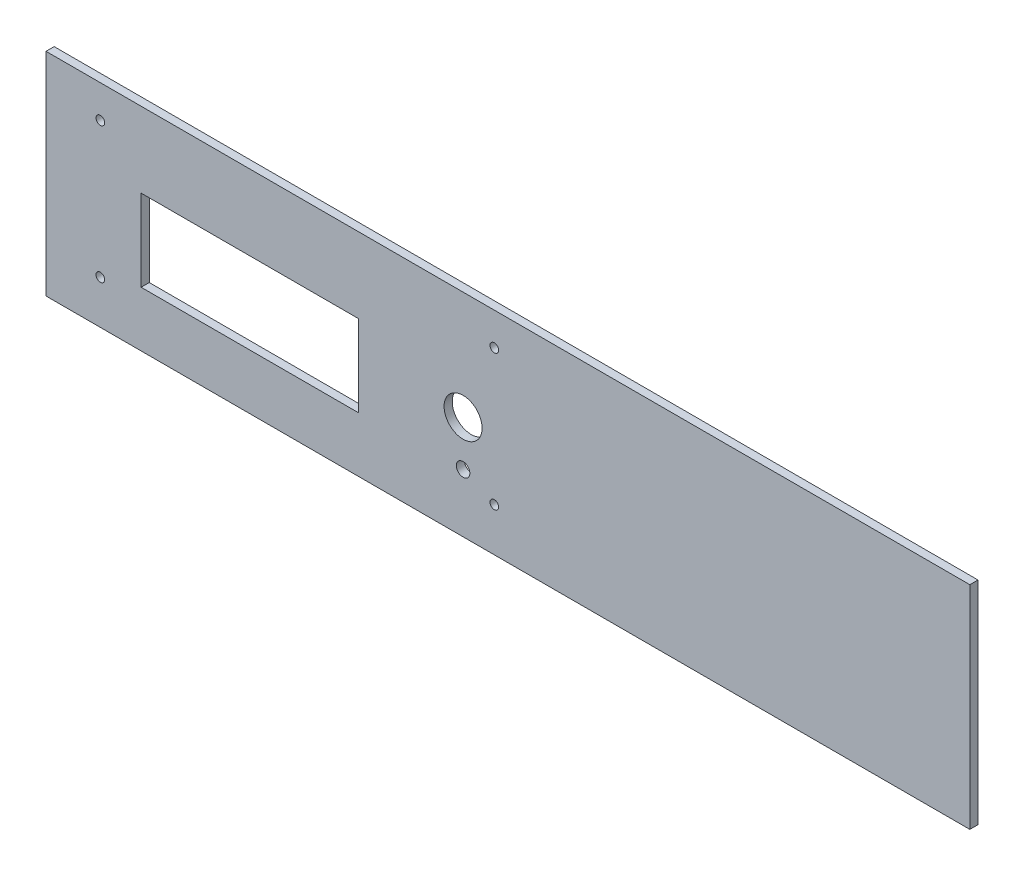
ISO-10303-21;
HEADER;
FILE_DESCRIPTION(('STEP AP214'),'2;1');
FILE_NAME('part.step','',(''),(''),'','','');
FILE_SCHEMA(('AUTOMOTIVE_DESIGN { 1 0 10303 214 1 1 1 1 }'));
ENDSEC;
DATA;
#1=APPLICATION_CONTEXT('core data for automotive mechanical design processes');
#2=APPLICATION_PROTOCOL_DEFINITION('international standard','automotive_design',2000,#1);
#3=PRODUCT_CONTEXT('',#1,'mechanical');
#4=PRODUCT('Part','Part','',(#3));
#5=PRODUCT_RELATED_PRODUCT_CATEGORY('part','',(#4));
#6=PRODUCT_DEFINITION_FORMATION('','',#4);
#7=PRODUCT_DEFINITION_CONTEXT('part definition',#1,'design');
#8=PRODUCT_DEFINITION('design','',#6,#7);
#9=PRODUCT_DEFINITION_SHAPE('','',#8);
#10=(LENGTH_UNIT() NAMED_UNIT(*) SI_UNIT(.MILLI.,.METRE.));
#11=(NAMED_UNIT(*) PLANE_ANGLE_UNIT() SI_UNIT($,.RADIAN.));
#12=(NAMED_UNIT(*) SI_UNIT($,.STERADIAN.) SOLID_ANGLE_UNIT());
#13=UNCERTAINTY_MEASURE_WITH_UNIT(LENGTH_MEASURE(1.E-05),#10,'distance_accuracy_value','');
#14=(GEOMETRIC_REPRESENTATION_CONTEXT(3) GLOBAL_UNCERTAINTY_ASSIGNED_CONTEXT((#13)) GLOBAL_UNIT_ASSIGNED_CONTEXT((#10,
#11,#12)) REPRESENTATION_CONTEXT('',''));
#15=CARTESIAN_POINT('',(0.,0.,0.));
#16=DIRECTION('',(0.,0.,1.));
#17=DIRECTION('',(1.,0.,0.));
#18=AXIS2_PLACEMENT_3D('',#15,#16,#17);
#19=CARTESIAN_POINT('',(-170.,39.,3.));
#20=DIRECTION('',(1.,0.,0.));
#21=DIRECTION('',(0.,0.,-1.));
#22=AXIS2_PLACEMENT_3D('',#19,#20,#21);
#23=PLANE('',#22);
#24=DIRECTION('',(0.,-1.,0.));
#25=VECTOR('',#24,1.);
#26=CARTESIAN_POINT('',(-170.,39.,0.));
#27=LINE('',#26,#25);
#28=CARTESIAN_POINT('',(-170.,39.,0.));
#29=VERTEX_POINT('',#28);
#30=CARTESIAN_POINT('',(-170.,-39.,0.));
#31=VERTEX_POINT('',#30);
#32=EDGE_CURVE('E159',#29,#31,#27,.T.);
#33=ORIENTED_EDGE('',*,*,#32,.T.);
#34=DIRECTION('',(0.,0.,-1.));
#35=VECTOR('',#34,1.);
#36=CARTESIAN_POINT('',(-170.,-39.,3.));
#37=LINE('',#36,#35);
#38=CARTESIAN_POINT('',(-170.,-39.,3.));
#39=VERTEX_POINT('',#38);
#40=EDGE_CURVE('E11',#39,#31,#37,.T.);
#41=ORIENTED_EDGE('',*,*,#40,.F.);
#42=DIRECTION('',(0.,-1.,0.));
#43=VECTOR('',#42,1.);
#44=CARTESIAN_POINT('',(-170.,39.,3.));
#45=LINE('',#44,#43);
#46=CARTESIAN_POINT('',(-170.,39.,3.));
#47=VERTEX_POINT('',#46);
#48=EDGE_CURVE('E162',#47,#39,#45,.T.);
#49=ORIENTED_EDGE('',*,*,#48,.F.);
#50=DIRECTION('',(0.,0.,-1.));
#51=VECTOR('',#50,1.);
#52=CARTESIAN_POINT('',(-170.,39.,3.));
#53=LINE('',#52,#51);
#54=EDGE_CURVE('E172',#47,#29,#53,.T.);
#55=ORIENTED_EDGE('',*,*,#54,.T.);
#56=EDGE_LOOP('',(#33,#41,#49,#55));
#57=FACE_BOUND('',#56,.T.);
#58=ADVANCED_FACE('F33',(#57),#23,.F.);
#59=CARTESIAN_POINT('',(-170.,-39.,3.));
#60=DIRECTION('',(0.,1.,0.));
#61=DIRECTION('',(0.,0.,1.));
#62=AXIS2_PLACEMENT_3D('',#59,#60,#61);
#63=PLANE('',#62);
#64=DIRECTION('',(1.,0.,0.));
#65=VECTOR('',#64,1.);
#66=CARTESIAN_POINT('',(-170.,-39.,0.));
#67=LINE('',#66,#65);
#68=CARTESIAN_POINT('',(170.,-39.,0.));
#69=VERTEX_POINT('',#68);
#70=EDGE_CURVE('E175',#31,#69,#67,.T.);
#71=ORIENTED_EDGE('',*,*,#70,.T.);
#72=DIRECTION('',(0.,0.,-1.));
#73=VECTOR('',#72,1.);
#74=CARTESIAN_POINT('',(170.,-39.,3.));
#75=LINE('',#74,#73);
#76=CARTESIAN_POINT('',(170.,-39.,3.));
#77=VERTEX_POINT('',#76);
#78=EDGE_CURVE('E40',#77,#69,#75,.T.);
#79=ORIENTED_EDGE('',*,*,#78,.F.);
#80=DIRECTION('',(1.,0.,0.));
#81=VECTOR('',#80,1.);
#82=CARTESIAN_POINT('',(-170.,-39.,3.));
#83=LINE('',#82,#81);
#84=EDGE_CURVE('E165',#39,#77,#83,.T.);
#85=ORIENTED_EDGE('',*,*,#84,.F.);
#86=ORIENTED_EDGE('',*,*,#40,.T.);
#87=EDGE_LOOP('',(#71,#79,#85,#86));
#88=FACE_BOUND('',#87,.T.);
#89=ADVANCED_FACE('F204',(#88),#63,.F.);
#90=CARTESIAN_POINT('',(170.,39.,3.));
#91=DIRECTION('',(-1.,0.,0.));
#92=DIRECTION('',(0.,0.,1.));
#93=AXIS2_PLACEMENT_3D('',#90,#91,#92);
#94=PLANE('',#93);
#95=DIRECTION('',(0.,1.,0.));
#96=VECTOR('',#95,1.);
#97=CARTESIAN_POINT('',(170.,39.,0.));
#98=LINE('',#97,#96);
#99=CARTESIAN_POINT('',(170.,39.,0.));
#100=VERTEX_POINT('',#99);
#101=EDGE_CURVE('E177',#69,#100,#98,.T.);
#102=ORIENTED_EDGE('',*,*,#101,.T.);
#103=DIRECTION('',(0.,0.,-1.));
#104=VECTOR('',#103,1.);
#105=CARTESIAN_POINT('',(170.,39.,3.));
#106=LINE('',#105,#104);
#107=CARTESIAN_POINT('',(170.,39.,3.));
#108=VERTEX_POINT('',#107);
#109=EDGE_CURVE('E182',#108,#100,#106,.T.);
#110=ORIENTED_EDGE('',*,*,#109,.F.);
#111=DIRECTION('',(0.,1.,0.));
#112=VECTOR('',#111,1.);
#113=CARTESIAN_POINT('',(170.,39.,3.));
#114=LINE('',#113,#112);
#115=EDGE_CURVE('E168',#77,#108,#114,.T.);
#116=ORIENTED_EDGE('',*,*,#115,.F.);
#117=ORIENTED_EDGE('',*,*,#78,.T.);
#118=EDGE_LOOP('',(#102,#110,#116,#117));
#119=FACE_BOUND('',#118,.T.);
#120=ADVANCED_FACE('F189',(#119),#94,.F.);
#121=CARTESIAN_POINT('',(-170.,39.,3.));
#122=DIRECTION('',(0.,-1.,0.));
#123=DIRECTION('',(1.,0.,0.));
#124=AXIS2_PLACEMENT_3D('',#121,#122,#123);
#125=PLANE('',#124);
#126=DIRECTION('',(-1.,0.,0.));
#127=VECTOR('',#126,1.);
#128=CARTESIAN_POINT('',(-170.,39.,0.));
#129=LINE('',#128,#127);
#130=EDGE_CURVE('E166',#100,#29,#129,.T.);
#131=ORIENTED_EDGE('',*,*,#130,.T.);
#132=ORIENTED_EDGE('',*,*,#54,.F.);
#133=DIRECTION('',(-1.,0.,0.));
#134=VECTOR('',#133,1.);
#135=CARTESIAN_POINT('',(-170.,39.,3.));
#136=LINE('',#135,#134);
#137=EDGE_CURVE('E170',#108,#47,#136,.T.);
#138=ORIENTED_EDGE('',*,*,#137,.F.);
#139=ORIENTED_EDGE('',*,*,#109,.T.);
#140=EDGE_LOOP('',(#131,#132,#138,#139));
#141=FACE_BOUND('',#140,.T.);
#142=ADVANCED_FACE('F197',(#141),#125,.F.);
#143=CARTESIAN_POINT('',(0.,0.,3.));
#144=DIRECTION('',(0.,0.,1.));
#145=DIRECTION('',(1.,0.,0.));
#146=AXIS2_PLACEMENT_3D('',#143,#144,#145);
#147=PLANE('',#146);
#148=CARTESIAN_POINT('',(-16.5000000000001,-17.5,3.));
#149=DIRECTION('',(0.,0.,1.));
#150=DIRECTION('',(1.,0.,0.));
#151=AXIS2_PLACEMENT_3D('',#148,#149,#150);
#152=CIRCLE('',#151,2.5);
#153=CARTESIAN_POINT('',(-14.0000000000001,-17.5,3.));
#154=VERTEX_POINT('',#153);
#155=EDGE_CURVE('E262',#154,#154,#152,.T.);
#156=ORIENTED_EDGE('',*,*,#155,.F.);
#157=EDGE_LOOP('',(#156));
#158=FACE_BOUND('',#157,.T.);
#159=CARTESIAN_POINT('',(-16.5000000000001,-0.900000000000005,3.));
#160=DIRECTION('',(0.,0.,1.));
#161=DIRECTION('',(1.,0.,0.));
#162=AXIS2_PLACEMENT_3D('',#159,#160,#161);
#163=CIRCLE('',#162,7.);
#164=CARTESIAN_POINT('',(-9.50000000000006,-0.900000000000005,3.));
#165=VERTEX_POINT('',#164);
#166=EDGE_CURVE('E121',#165,#165,#163,.T.);
#167=ORIENTED_EDGE('',*,*,#166,.F.);
#168=EDGE_LOOP('',(#167));
#169=FACE_BOUND('',#168,.T.);
#170=DIRECTION('',(0.,-1.,0.));
#171=VECTOR('',#170,1.);
#172=CARTESIAN_POINT('',(-135.,11.3,3.));
#173=LINE('',#172,#171);
#174=CARTESIAN_POINT('',(-135.,11.3,3.));
#175=VERTEX_POINT('',#174);
#176=CARTESIAN_POINT('',(-135.,-18.7,3.));
#177=VERTEX_POINT('',#176);
#178=EDGE_CURVE('E47',#175,#177,#173,.T.);
#179=ORIENTED_EDGE('',*,*,#178,.F.);
#180=DIRECTION('',(-1.,0.,0.));
#181=VECTOR('',#180,1.);
#182=CARTESIAN_POINT('',(-135.,11.3,3.));
#183=LINE('',#182,#181);
#184=CARTESIAN_POINT('',(-55.,11.3,3.));
#185=VERTEX_POINT('',#184);
#186=EDGE_CURVE('E115',#185,#175,#183,.T.);
#187=ORIENTED_EDGE('',*,*,#186,.F.);
#188=DIRECTION('',(0.,1.,0.));
#189=VECTOR('',#188,1.);
#190=CARTESIAN_POINT('',(-55.,11.3,3.));
#191=LINE('',#190,#189);
#192=CARTESIAN_POINT('',(-55.,-18.7,3.));
#193=VERTEX_POINT('',#192);
#194=EDGE_CURVE('E118',#193,#185,#191,.T.);
#195=ORIENTED_EDGE('',*,*,#194,.F.);
#196=DIRECTION('',(1.,0.,0.));
#197=VECTOR('',#196,1.);
#198=CARTESIAN_POINT('',(-135.,-18.7,3.));
#199=LINE('',#198,#197);
#200=EDGE_CURVE('E127',#177,#193,#199,.T.);
#201=ORIENTED_EDGE('',*,*,#200,.F.);
#202=EDGE_LOOP('',(#179,#187,#195,#201));
#203=FACE_BOUND('',#202,.T.);
#204=CARTESIAN_POINT('',(-5.00000000000009,-23.,3.));
#205=DIRECTION('',(0.,0.,1.));
#206=DIRECTION('',(1.,0.,0.));
#207=AXIS2_PLACEMENT_3D('',#204,#205,#206);
#208=CIRCLE('',#207,1.6);
#209=CARTESIAN_POINT('',(-3.40000000000009,-23.,3.));
#210=VERTEX_POINT('',#209);
#211=EDGE_CURVE('E134',#210,#210,#208,.T.);
#212=ORIENTED_EDGE('',*,*,#211,.F.);
#213=EDGE_LOOP('',(#212));
#214=FACE_BOUND('',#213,.T.);
#215=CARTESIAN_POINT('',(-5.00000000000006,27.,3.));
#216=DIRECTION('',(0.,0.,1.));
#217=DIRECTION('',(1.,0.,0.));
#218=AXIS2_PLACEMENT_3D('',#215,#216,#217);
#219=CIRCLE('',#218,1.6);
#220=CARTESIAN_POINT('',(-3.40000000000006,27.,3.));
#221=VERTEX_POINT('',#220);
#222=EDGE_CURVE('E141',#221,#221,#219,.T.);
#223=ORIENTED_EDGE('',*,*,#222,.F.);
#224=EDGE_LOOP('',(#223));
#225=FACE_BOUND('',#224,.T.);
#226=CARTESIAN_POINT('',(-150.,-23.,3.));
#227=DIRECTION('',(0.,0.,1.));
#228=DIRECTION('',(1.,0.,0.));
#229=AXIS2_PLACEMENT_3D('',#226,#227,#228);
#230=CIRCLE('',#229,1.59999999999999);
#231=CARTESIAN_POINT('',(-148.4,-23.,3.));
#232=VERTEX_POINT('',#231);
#233=EDGE_CURVE('E147',#232,#232,#230,.T.);
#234=ORIENTED_EDGE('',*,*,#233,.F.);
#235=EDGE_LOOP('',(#234));
#236=FACE_BOUND('',#235,.T.);
#237=CARTESIAN_POINT('',(-150.,27.,3.));
#238=DIRECTION('',(0.,0.,1.));
#239=DIRECTION('',(1.,0.,0.));
#240=AXIS2_PLACEMENT_3D('',#237,#238,#239);
#241=CIRCLE('',#240,1.59999999999999);
#242=CARTESIAN_POINT('',(-148.4,27.,3.));
#243=VERTEX_POINT('',#242);
#244=EDGE_CURVE('E153',#243,#243,#241,.T.);
#245=ORIENTED_EDGE('',*,*,#244,.F.);
#246=EDGE_LOOP('',(#245));
#247=FACE_BOUND('',#246,.T.);
#248=ORIENTED_EDGE('',*,*,#48,.T.);
#249=ORIENTED_EDGE('',*,*,#84,.T.);
#250=ORIENTED_EDGE('',*,*,#115,.T.);
#251=ORIENTED_EDGE('',*,*,#137,.T.);
#252=EDGE_LOOP('',(#248,#249,#250,#251));
#253=FACE_BOUND('',#252,.T.);
#254=ADVANCED_FACE('F203',(#158,#169,#203,#214,#225,#236,#247,#253),#147,.T.);
#255=CARTESIAN_POINT('',(0.,0.,0.));
#256=DIRECTION('',(0.,0.,1.));
#257=DIRECTION('',(1.,0.,0.));
#258=AXIS2_PLACEMENT_3D('',#255,#256,#257);
#259=PLANE('',#258);
#260=CARTESIAN_POINT('',(-16.5000000000001,-17.5,0.));
#261=DIRECTION('',(0.,0.,1.));
#262=DIRECTION('',(1.,0.,0.));
#263=AXIS2_PLACEMENT_3D('',#260,#261,#262);
#264=CIRCLE('',#263,2.5);
#265=CARTESIAN_POINT('',(-14.0000000000001,-17.5,0.));
#266=VERTEX_POINT('',#265);
#267=EDGE_CURVE('E259',#266,#266,#264,.T.);
#268=ORIENTED_EDGE('',*,*,#267,.T.);
#269=EDGE_LOOP('',(#268));
#270=FACE_BOUND('',#269,.T.);
#271=CARTESIAN_POINT('',(-16.5000000000001,-0.900000000000005,0.));
#272=DIRECTION('',(0.,0.,1.));
#273=DIRECTION('',(1.,0.,0.));
#274=AXIS2_PLACEMENT_3D('',#271,#272,#273);
#275=CIRCLE('',#274,7.);
#276=CARTESIAN_POINT('',(-9.50000000000006,-0.900000000000005,0.));
#277=VERTEX_POINT('',#276);
#278=EDGE_CURVE('E128',#277,#277,#275,.T.);
#279=ORIENTED_EDGE('',*,*,#278,.T.);
#280=EDGE_LOOP('',(#279));
#281=FACE_BOUND('',#280,.T.);
#282=DIRECTION('',(-1.,0.,0.));
#283=VECTOR('',#282,1.);
#284=CARTESIAN_POINT('',(-135.,11.3,0.));
#285=LINE('',#284,#283);
#286=CARTESIAN_POINT('',(-55.,11.3,0.));
#287=VERTEX_POINT('',#286);
#288=CARTESIAN_POINT('',(-135.,11.3,0.));
#289=VERTEX_POINT('',#288);
#290=EDGE_CURVE('E105',#287,#289,#285,.T.);
#291=ORIENTED_EDGE('',*,*,#290,.T.);
#292=DIRECTION('',(0.,-1.,0.));
#293=VECTOR('',#292,1.);
#294=CARTESIAN_POINT('',(-135.,11.3,0.));
#295=LINE('',#294,#293);
#296=CARTESIAN_POINT('',(-135.,-18.7,0.));
#297=VERTEX_POINT('',#296);
#298=EDGE_CURVE('E99',#289,#297,#295,.T.);
#299=ORIENTED_EDGE('',*,*,#298,.T.);
#300=DIRECTION('',(1.,0.,0.));
#301=VECTOR('',#300,1.);
#302=CARTESIAN_POINT('',(-135.,-18.7,0.));
#303=LINE('',#302,#301);
#304=CARTESIAN_POINT('',(-55.,-18.7,0.));
#305=VERTEX_POINT('',#304);
#306=EDGE_CURVE('E108',#297,#305,#303,.T.);
#307=ORIENTED_EDGE('',*,*,#306,.T.);
#308=DIRECTION('',(0.,1.,0.));
#309=VECTOR('',#308,1.);
#310=CARTESIAN_POINT('',(-55.,11.3,0.));
#311=LINE('',#310,#309);
#312=EDGE_CURVE('E55',#305,#287,#311,.T.);
#313=ORIENTED_EDGE('',*,*,#312,.T.);
#314=EDGE_LOOP('',(#291,#299,#307,#313));
#315=FACE_BOUND('',#314,.T.);
#316=CARTESIAN_POINT('',(-5.00000000000009,-23.,0.));
#317=DIRECTION('',(0.,0.,1.));
#318=DIRECTION('',(1.,0.,0.));
#319=AXIS2_PLACEMENT_3D('',#316,#317,#318);
#320=CIRCLE('',#319,1.6);
#321=CARTESIAN_POINT('',(-3.40000000000009,-23.,0.));
#322=VERTEX_POINT('',#321);
#323=EDGE_CURVE('E138',#322,#322,#320,.T.);
#324=ORIENTED_EDGE('',*,*,#323,.T.);
#325=EDGE_LOOP('',(#324));
#326=FACE_BOUND('',#325,.T.);
#327=CARTESIAN_POINT('',(-5.00000000000006,27.,0.));
#328=DIRECTION('',(0.,0.,1.));
#329=DIRECTION('',(1.,0.,0.));
#330=AXIS2_PLACEMENT_3D('',#327,#328,#329);
#331=CIRCLE('',#330,1.6);
#332=CARTESIAN_POINT('',(-3.40000000000006,27.,0.));
#333=VERTEX_POINT('',#332);
#334=EDGE_CURVE('E144',#333,#333,#331,.T.);
#335=ORIENTED_EDGE('',*,*,#334,.T.);
#336=EDGE_LOOP('',(#335));
#337=FACE_BOUND('',#336,.T.);
#338=CARTESIAN_POINT('',(-150.,-23.,0.));
#339=DIRECTION('',(0.,0.,1.));
#340=DIRECTION('',(1.,0.,0.));
#341=AXIS2_PLACEMENT_3D('',#338,#339,#340);
#342=CIRCLE('',#341,1.59999999999999);
#343=CARTESIAN_POINT('',(-148.4,-23.,0.));
#344=VERTEX_POINT('',#343);
#345=EDGE_CURVE('E150',#344,#344,#342,.T.);
#346=ORIENTED_EDGE('',*,*,#345,.T.);
#347=EDGE_LOOP('',(#346));
#348=FACE_BOUND('',#347,.T.);
#349=CARTESIAN_POINT('',(-150.,27.,0.));
#350=DIRECTION('',(0.,0.,1.));
#351=DIRECTION('',(1.,0.,0.));
#352=AXIS2_PLACEMENT_3D('',#349,#350,#351);
#353=CIRCLE('',#352,1.59999999999999);
#354=CARTESIAN_POINT('',(-148.4,27.,0.));
#355=VERTEX_POINT('',#354);
#356=EDGE_CURVE('E156',#355,#355,#353,.T.);
#357=ORIENTED_EDGE('',*,*,#356,.T.);
#358=EDGE_LOOP('',(#357));
#359=FACE_BOUND('',#358,.T.);
#360=ORIENTED_EDGE('',*,*,#32,.F.);
#361=ORIENTED_EDGE('',*,*,#130,.F.);
#362=ORIENTED_EDGE('',*,*,#101,.F.);
#363=ORIENTED_EDGE('',*,*,#70,.F.);
#364=EDGE_LOOP('',(#360,#361,#362,#363));
#365=FACE_BOUND('',#364,.T.);
#366=ADVANCED_FACE('F112',(#270,#281,#315,#326,#337,#348,#359,#365),#259,.F.);
#367=CARTESIAN_POINT('',(-150.,27.,0.));
#368=DIRECTION('',(0.,0.,1.));
#369=DIRECTION('',(1.,0.,0.));
#370=AXIS2_PLACEMENT_3D('',#367,#368,#369);
#371=CYLINDRICAL_SURFACE('',#370,1.59999999999999);
#372=ORIENTED_EDGE('',*,*,#356,.F.);
#373=EDGE_LOOP('',(#372));
#374=FACE_BOUND('',#373,.T.);
#375=ORIENTED_EDGE('',*,*,#244,.T.);
#376=EDGE_LOOP('',(#375));
#377=FACE_BOUND('',#376,.T.);
#378=ADVANCED_FACE('F216',(#374,#377),#371,.F.);
#379=CARTESIAN_POINT('',(-150.,-23.,0.));
#380=DIRECTION('',(0.,0.,1.));
#381=DIRECTION('',(1.,0.,0.));
#382=AXIS2_PLACEMENT_3D('',#379,#380,#381);
#383=CYLINDRICAL_SURFACE('',#382,1.59999999999999);
#384=ORIENTED_EDGE('',*,*,#345,.F.);
#385=EDGE_LOOP('',(#384));
#386=FACE_BOUND('',#385,.T.);
#387=ORIENTED_EDGE('',*,*,#233,.T.);
#388=EDGE_LOOP('',(#387));
#389=FACE_BOUND('',#388,.T.);
#390=ADVANCED_FACE('F223',(#386,#389),#383,.F.);
#391=CARTESIAN_POINT('',(-5.00000000000006,27.,0.));
#392=DIRECTION('',(0.,0.,1.));
#393=DIRECTION('',(1.,0.,0.));
#394=AXIS2_PLACEMENT_3D('',#391,#392,#393);
#395=CYLINDRICAL_SURFACE('',#394,1.6);
#396=ORIENTED_EDGE('',*,*,#334,.F.);
#397=EDGE_LOOP('',(#396));
#398=FACE_BOUND('',#397,.T.);
#399=ORIENTED_EDGE('',*,*,#222,.T.);
#400=EDGE_LOOP('',(#399));
#401=FACE_BOUND('',#400,.T.);
#402=ADVANCED_FACE('F227',(#398,#401),#395,.F.);
#403=CARTESIAN_POINT('',(-5.00000000000009,-23.,0.));
#404=DIRECTION('',(0.,0.,1.));
#405=DIRECTION('',(1.,0.,0.));
#406=AXIS2_PLACEMENT_3D('',#403,#404,#405);
#407=CYLINDRICAL_SURFACE('',#406,1.6);
#408=ORIENTED_EDGE('',*,*,#323,.F.);
#409=EDGE_LOOP('',(#408));
#410=FACE_BOUND('',#409,.T.);
#411=ORIENTED_EDGE('',*,*,#211,.T.);
#412=EDGE_LOOP('',(#411));
#413=FACE_BOUND('',#412,.T.);
#414=ADVANCED_FACE('F231',(#410,#413),#407,.F.);
#415=CARTESIAN_POINT('',(-135.,11.3,0.));
#416=DIRECTION('',(-1.,0.,0.));
#417=DIRECTION('',(0.,-1.,0.));
#418=AXIS2_PLACEMENT_3D('',#415,#416,#417);
#419=PLANE('',#418);
#420=ORIENTED_EDGE('',*,*,#178,.T.);
#421=DIRECTION('',(0.,0.,1.));
#422=VECTOR('',#421,1.);
#423=CARTESIAN_POINT('',(-135.,-18.7,0.));
#424=LINE('',#423,#422);
#425=EDGE_CURVE('E95',#297,#177,#424,.T.);
#426=ORIENTED_EDGE('',*,*,#425,.F.);
#427=ORIENTED_EDGE('',*,*,#298,.F.);
#428=DIRECTION('',(0.,0.,1.));
#429=VECTOR('',#428,1.);
#430=CARTESIAN_POINT('',(-135.,11.3,0.));
#431=LINE('',#430,#429);
#432=EDGE_CURVE('E132',#289,#175,#431,.T.);
#433=ORIENTED_EDGE('',*,*,#432,.T.);
#434=EDGE_LOOP('',(#420,#426,#427,#433));
#435=FACE_BOUND('',#434,.T.);
#436=ADVANCED_FACE('F97',(#435),#419,.F.);
#437=CARTESIAN_POINT('',(-135.,11.3,0.));
#438=DIRECTION('',(0.,1.,0.));
#439=DIRECTION('',(0.,0.,1.));
#440=AXIS2_PLACEMENT_3D('',#437,#438,#439);
#441=PLANE('',#440);
#442=ORIENTED_EDGE('',*,*,#186,.T.);
#443=ORIENTED_EDGE('',*,*,#432,.F.);
#444=ORIENTED_EDGE('',*,*,#290,.F.);
#445=DIRECTION('',(0.,0.,1.));
#446=VECTOR('',#445,1.);
#447=CARTESIAN_POINT('',(-55.,11.3,0.));
#448=LINE('',#447,#446);
#449=EDGE_CURVE('E135',#287,#185,#448,.T.);
#450=ORIENTED_EDGE('',*,*,#449,.T.);
#451=EDGE_LOOP('',(#442,#443,#444,#450));
#452=FACE_BOUND('',#451,.T.);
#453=ADVANCED_FACE('F238',(#452),#441,.F.);
#454=CARTESIAN_POINT('',(-55.,11.3,0.));
#455=DIRECTION('',(1.,0.,0.));
#456=DIRECTION('',(0.,1.,0.));
#457=AXIS2_PLACEMENT_3D('',#454,#455,#456);
#458=PLANE('',#457);
#459=ORIENTED_EDGE('',*,*,#194,.T.);
#460=ORIENTED_EDGE('',*,*,#449,.F.);
#461=ORIENTED_EDGE('',*,*,#312,.F.);
#462=DIRECTION('',(0.,0.,1.));
#463=VECTOR('',#462,1.);
#464=CARTESIAN_POINT('',(-55.,-18.7,0.));
#465=LINE('',#464,#463);
#466=EDGE_CURVE('E104',#305,#193,#465,.T.);
#467=ORIENTED_EDGE('',*,*,#466,.T.);
#468=EDGE_LOOP('',(#459,#460,#461,#467));
#469=FACE_BOUND('',#468,.T.);
#470=ADVANCED_FACE('F242',(#469),#458,.F.);
#471=CARTESIAN_POINT('',(-135.,-18.7,0.));
#472=DIRECTION('',(0.,-1.,0.));
#473=DIRECTION('',(0.,0.,-1.));
#474=AXIS2_PLACEMENT_3D('',#471,#472,#473);
#475=PLANE('',#474);
#476=ORIENTED_EDGE('',*,*,#200,.T.);
#477=ORIENTED_EDGE('',*,*,#466,.F.);
#478=ORIENTED_EDGE('',*,*,#306,.F.);
#479=ORIENTED_EDGE('',*,*,#425,.T.);
#480=EDGE_LOOP('',(#476,#477,#478,#479));
#481=FACE_BOUND('',#480,.T.);
#482=ADVANCED_FACE('F109',(#481),#475,.F.);
#483=CARTESIAN_POINT('',(-16.5000000000001,-0.900000000000005,0.));
#484=DIRECTION('',(0.,0.,1.));
#485=DIRECTION('',(1.,0.,0.));
#486=AXIS2_PLACEMENT_3D('',#483,#484,#485);
#487=CYLINDRICAL_SURFACE('',#486,7.);
#488=ORIENTED_EDGE('',*,*,#278,.F.);
#489=EDGE_LOOP('',(#488));
#490=FACE_BOUND('',#489,.T.);
#491=ORIENTED_EDGE('',*,*,#166,.T.);
#492=EDGE_LOOP('',(#491));
#493=FACE_BOUND('',#492,.T.);
#494=ADVANCED_FACE('F241',(#490,#493),#487,.F.);
#495=CARTESIAN_POINT('',(-16.5000000000001,-17.5,0.));
#496=DIRECTION('',(0.,0.,1.));
#497=DIRECTION('',(1.,0.,0.));
#498=AXIS2_PLACEMENT_3D('',#495,#496,#497);
#499=CYLINDRICAL_SURFACE('',#498,2.5);
#500=ORIENTED_EDGE('',*,*,#267,.F.);
#501=EDGE_LOOP('',(#500));
#502=FACE_BOUND('',#501,.T.);
#503=ORIENTED_EDGE('',*,*,#155,.T.);
#504=EDGE_LOOP('',(#503));
#505=FACE_BOUND('',#504,.T.);
#506=ADVANCED_FACE('F250',(#502,#505),#499,.F.);
#507=CLOSED_SHELL('',(#58,#89,#120,#142,#254,#366,#378,#390,#402,#414,#436,#453,#470,#482,#494,#506));
#508=MANIFOLD_SOLID_BREP('B2',#507);
#509=ADVANCED_BREP_SHAPE_REPRESENTATION('',(#18,#508),#14);
#510=SHAPE_DEFINITION_REPRESENTATION(#9,#509);
ENDSEC;
END-ISO-10303-21;
